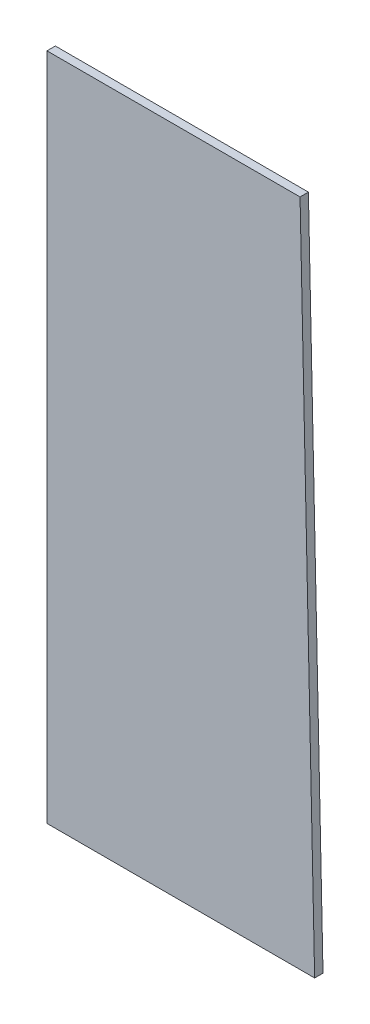
ISO-10303-21;
HEADER;
FILE_DESCRIPTION(('STEP AP214'),'2;1');
FILE_NAME('part.step','',(''),(''),'','','');
FILE_SCHEMA(('AUTOMOTIVE_DESIGN { 1 0 10303 214 1 1 1 1 }'));
ENDSEC;
DATA;
#1=APPLICATION_CONTEXT('core data for automotive mechanical design processes');
#2=APPLICATION_PROTOCOL_DEFINITION('international standard','automotive_design',2000,#1);
#3=PRODUCT_CONTEXT('',#1,'mechanical');
#4=PRODUCT('Part','Part','',(#3));
#5=PRODUCT_RELATED_PRODUCT_CATEGORY('part','',(#4));
#6=PRODUCT_DEFINITION_FORMATION('','',#4);
#7=PRODUCT_DEFINITION_CONTEXT('part definition',#1,'design');
#8=PRODUCT_DEFINITION('design','',#6,#7);
#9=PRODUCT_DEFINITION_SHAPE('','',#8);
#10=(LENGTH_UNIT() NAMED_UNIT(*) SI_UNIT(.MILLI.,.METRE.));
#11=(NAMED_UNIT(*) PLANE_ANGLE_UNIT() SI_UNIT($,.RADIAN.));
#12=(NAMED_UNIT(*) SI_UNIT($,.STERADIAN.) SOLID_ANGLE_UNIT());
#13=UNCERTAINTY_MEASURE_WITH_UNIT(LENGTH_MEASURE(1.E-05),#10,'distance_accuracy_value','');
#14=(GEOMETRIC_REPRESENTATION_CONTEXT(3) GLOBAL_UNCERTAINTY_ASSIGNED_CONTEXT((#13)) GLOBAL_UNIT_ASSIGNED_CONTEXT((#10,
#11,#12)) REPRESENTATION_CONTEXT('',''));
#15=CARTESIAN_POINT('',(0.,0.,0.));
#16=DIRECTION('',(0.,0.,1.));
#17=DIRECTION('',(1.,0.,0.));
#18=AXIS2_PLACEMENT_3D('',#15,#16,#17);
#19=CARTESIAN_POINT('',(0.,4000.,0.));
#20=DIRECTION('',(0.,-1.,0.));
#21=DIRECTION('',(-1.,0.,0.));
#22=AXIS2_PLACEMENT_3D('',#19,#20,#21);
#23=PLANE('',#22);
#24=DIRECTION('',(0.,0.,1.));
#25=VECTOR('',#24,1.);
#26=CARTESIAN_POINT('',(1512.79175791979,4000.,0.));
#27=LINE('',#26,#25);
#28=CARTESIAN_POINT('',(1512.79175791979,4000.,-50.));
#29=VERTEX_POINT('',#28);
#30=CARTESIAN_POINT('',(1512.79175791979,4000.,0.));
#31=VERTEX_POINT('',#30);
#32=EDGE_CURVE('E12',#29,#31,#27,.T.);
#33=ORIENTED_EDGE('',*,*,#32,.F.);
#34=DIRECTION('',(-1.,0.,0.));
#35=VECTOR('',#34,1.);
#36=CARTESIAN_POINT('',(0.,4000.,-50.));
#37=LINE('',#36,#35);
#38=CARTESIAN_POINT('',(0.,4000.,-50.));
#39=VERTEX_POINT('',#38);
#40=EDGE_CURVE('E110',#29,#39,#37,.T.);
#41=ORIENTED_EDGE('',*,*,#40,.T.);
#42=DIRECTION('',(0.,0.,1.));
#43=VECTOR('',#42,1.);
#44=CARTESIAN_POINT('',(0.,4000.,0.));
#45=LINE('',#44,#43);
#46=CARTESIAN_POINT('',(0.,4000.,0.));
#47=VERTEX_POINT('',#46);
#48=EDGE_CURVE('E64',#39,#47,#45,.T.);
#49=ORIENTED_EDGE('',*,*,#48,.T.);
#50=DIRECTION('',(-1.,0.,0.));
#51=VECTOR('',#50,1.);
#52=CARTESIAN_POINT('',(0.,4000.,0.));
#53=LINE('',#52,#51);
#54=EDGE_CURVE('E125',#31,#47,#53,.T.);
#55=ORIENTED_EDGE('',*,*,#54,.F.);
#56=EDGE_LOOP('',(#33,#41,#49,#55));
#57=FACE_BOUND('',#56,.T.);
#58=ADVANCED_FACE('F53',(#57),#23,.F.);
#59=CARTESIAN_POINT('',(0.,0.,0.));
#60=DIRECTION('',(1.,0.,0.));
#61=DIRECTION('',(0.,-1.,0.));
#62=AXIS2_PLACEMENT_3D('',#59,#60,#61);
#63=PLANE('',#62);
#64=ORIENTED_EDGE('',*,*,#48,.F.);
#65=DIRECTION('',(0.,1.,0.));
#66=VECTOR('',#65,1.);
#67=CARTESIAN_POINT('',(0.,0.,-50.));
#68=LINE('',#67,#66);
#69=CARTESIAN_POINT('',(0.,0.,-50.));
#70=VERTEX_POINT('',#69);
#71=EDGE_CURVE('E118',#39,#70,#68,.F.);
#72=ORIENTED_EDGE('',*,*,#71,.T.);
#73=DIRECTION('',(0.,0.,1.));
#74=VECTOR('',#73,1.);
#75=CARTESIAN_POINT('',(0.,0.,0.));
#76=LINE('',#75,#74);
#77=CARTESIAN_POINT('',(0.,0.,0.));
#78=VERTEX_POINT('',#77);
#79=EDGE_CURVE('E72',#70,#78,#76,.T.);
#80=ORIENTED_EDGE('',*,*,#79,.T.);
#81=DIRECTION('',(0.,-1.,0.));
#82=VECTOR('',#81,1.);
#83=CARTESIAN_POINT('',(0.,0.,0.));
#84=LINE('',#83,#82);
#85=EDGE_CURVE('E104',#47,#78,#84,.T.);
#86=ORIENTED_EDGE('',*,*,#85,.F.);
#87=EDGE_LOOP('',(#64,#72,#80,#86));
#88=FACE_BOUND('',#87,.T.);
#89=ADVANCED_FACE('F130',(#88),#63,.F.);
#90=CARTESIAN_POINT('',(1600.,0.,0.));
#91=DIRECTION('',(0.,1.,0.));
#92=DIRECTION('',(1.,0.,0.));
#93=AXIS2_PLACEMENT_3D('',#90,#91,#92);
#94=PLANE('',#93);
#95=ORIENTED_EDGE('',*,*,#79,.F.);
#96=DIRECTION('',(-1.,0.,0.));
#97=VECTOR('',#96,1.);
#98=CARTESIAN_POINT('',(0.,0.,-50.));
#99=LINE('',#98,#97);
#100=CARTESIAN_POINT('',(1600.,0.,-50.));
#101=VERTEX_POINT('',#100);
#102=EDGE_CURVE('E109',#70,#101,#99,.F.);
#103=ORIENTED_EDGE('',*,*,#102,.T.);
#104=DIRECTION('',(0.,0.,1.));
#105=VECTOR('',#104,1.);
#106=CARTESIAN_POINT('',(1600.,0.,0.));
#107=LINE('',#106,#105);
#108=CARTESIAN_POINT('',(1600.,0.,0.));
#109=VERTEX_POINT('',#108);
#110=EDGE_CURVE('E57',#101,#109,#107,.T.);
#111=ORIENTED_EDGE('',*,*,#110,.T.);
#112=DIRECTION('',(1.,0.,0.));
#113=VECTOR('',#112,1.);
#114=CARTESIAN_POINT('',(1600.,0.,0.));
#115=LINE('',#114,#113);
#116=EDGE_CURVE('E120',#78,#109,#115,.T.);
#117=ORIENTED_EDGE('',*,*,#116,.F.);
#118=EDGE_LOOP('',(#95,#103,#111,#117));
#119=FACE_BOUND('',#118,.T.);
#120=ADVANCED_FACE('F113',(#119),#94,.F.);
#121=CARTESIAN_POINT('',(1512.79175791979,4000.,0.));
#122=DIRECTION('',(-0.999762419771915,-0.0217968807815413,0.));
#123=DIRECTION('',(-0.0217968807815413,0.999762419771915,0.));
#124=AXIS2_PLACEMENT_3D('',#121,#122,#123);
#125=PLANE('',#124);
#126=DIRECTION('',(-0.0217968807815413,0.999762419771915,0.));
#127=VECTOR('',#126,1.);
#128=CARTESIAN_POINT('',(1512.79175791979,4000.,-50.));
#129=LINE('',#128,#127);
#130=EDGE_CURVE('E98',#101,#29,#129,.T.);
#131=ORIENTED_EDGE('',*,*,#130,.T.);
#132=ORIENTED_EDGE('',*,*,#32,.T.);
#133=DIRECTION('',(-0.0217968807815413,0.999762419771915,0.));
#134=VECTOR('',#133,1.);
#135=CARTESIAN_POINT('',(1512.79175791979,4000.,0.));
#136=LINE('',#135,#134);
#137=EDGE_CURVE('E100',#109,#31,#136,.T.);
#138=ORIENTED_EDGE('',*,*,#137,.F.);
#139=ORIENTED_EDGE('',*,*,#110,.F.);
#140=EDGE_LOOP('',(#131,#132,#138,#139));
#141=FACE_BOUND('',#140,.T.);
#142=ADVANCED_FACE('F55',(#141),#125,.F.);
#143=CARTESIAN_POINT('',(0.,0.,0.));
#144=DIRECTION('',(0.,0.,-1.));
#145=DIRECTION('',(-1.,0.,0.));
#146=AXIS2_PLACEMENT_3D('',#143,#144,#145);
#147=PLANE('',#146);
#148=ORIENTED_EDGE('',*,*,#116,.T.);
#149=ORIENTED_EDGE('',*,*,#137,.T.);
#150=ORIENTED_EDGE('',*,*,#54,.T.);
#151=ORIENTED_EDGE('',*,*,#85,.T.);
#152=EDGE_LOOP('',(#148,#149,#150,#151));
#153=FACE_BOUND('',#152,.T.);
#154=ADVANCED_FACE('F128',(#153),#147,.F.);
#155=CARTESIAN_POINT('',(0.,0.,-50.));
#156=DIRECTION('',(0.,0.,-1.));
#157=DIRECTION('',(-1.,0.,0.));
#158=AXIS2_PLACEMENT_3D('',#155,#156,#157);
#159=PLANE('',#158);
#160=ORIENTED_EDGE('',*,*,#102,.F.);
#161=ORIENTED_EDGE('',*,*,#71,.F.);
#162=ORIENTED_EDGE('',*,*,#40,.F.);
#163=ORIENTED_EDGE('',*,*,#130,.F.);
#164=EDGE_LOOP('',(#160,#161,#162,#163));
#165=FACE_BOUND('',#164,.T.);
#166=ADVANCED_FACE('F107',(#165),#159,.T.);
#167=CLOSED_SHELL('',(#58,#89,#120,#142,#154,#166));
#168=MANIFOLD_SOLID_BREP('B2',#167);
#169=ADVANCED_BREP_SHAPE_REPRESENTATION('',(#18,#168),#14);
#170=SHAPE_DEFINITION_REPRESENTATION(#9,#169);
ENDSEC;
END-ISO-10303-21;
